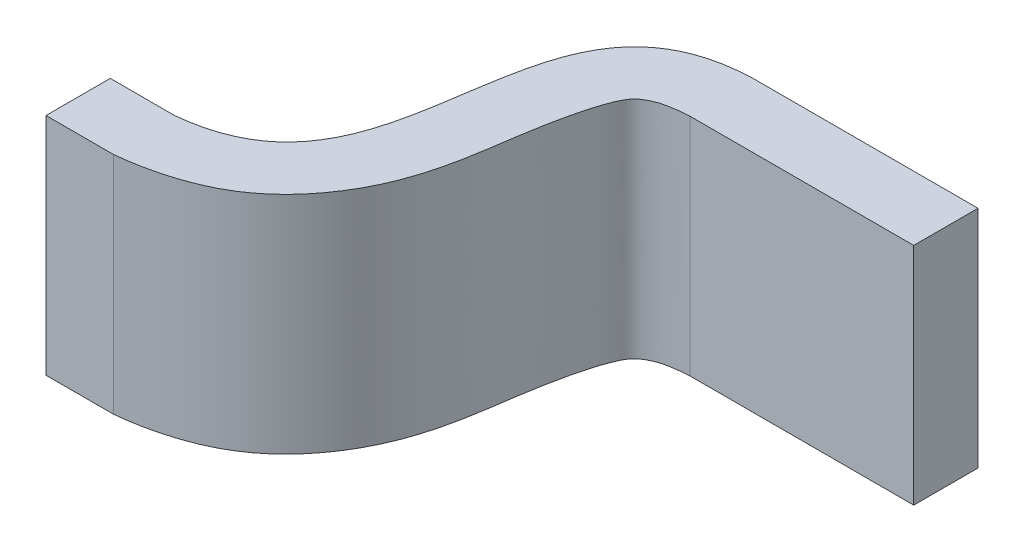
ISO-10303-21;
HEADER;
FILE_DESCRIPTION(('STEP AP214'),'2;1');
FILE_NAME('part.step','',(''),(''),'','','');
FILE_SCHEMA(('AUTOMOTIVE_DESIGN { 1 0 10303 214 1 1 1 1 }'));
ENDSEC;
DATA;
#1=APPLICATION_CONTEXT('core data for automotive mechanical design processes');
#2=APPLICATION_PROTOCOL_DEFINITION('international standard','automotive_design',2000,#1);
#3=PRODUCT_CONTEXT('',#1,'mechanical');
#4=PRODUCT('Part','Part','',(#3));
#5=PRODUCT_RELATED_PRODUCT_CATEGORY('part','',(#4));
#6=PRODUCT_DEFINITION_FORMATION('','',#4);
#7=PRODUCT_DEFINITION_CONTEXT('part definition',#1,'design');
#8=PRODUCT_DEFINITION('design','',#6,#7);
#9=PRODUCT_DEFINITION_SHAPE('','',#8);
#10=(LENGTH_UNIT() NAMED_UNIT(*) SI_UNIT(.MILLI.,.METRE.));
#11=(NAMED_UNIT(*) PLANE_ANGLE_UNIT() SI_UNIT($,.RADIAN.));
#12=(NAMED_UNIT(*) SI_UNIT($,.STERADIAN.) SOLID_ANGLE_UNIT());
#13=UNCERTAINTY_MEASURE_WITH_UNIT(LENGTH_MEASURE(1.E-05),#10,'distance_accuracy_value','');
#14=(GEOMETRIC_REPRESENTATION_CONTEXT(3) GLOBAL_UNCERTAINTY_ASSIGNED_CONTEXT((#13)) GLOBAL_UNIT_ASSIGNED_CONTEXT((#10,
#11,#12)) REPRESENTATION_CONTEXT('',''));
#15=CARTESIAN_POINT('',(0.,0.,0.));
#16=DIRECTION('',(0.,0.,1.));
#17=DIRECTION('',(1.,0.,0.));
#18=AXIS2_PLACEMENT_3D('',#15,#16,#17);
#19=CARTESIAN_POINT('',(0.381074398756027,-1.47690082967439,1.19999994098963));
#20=DIRECTION('',(0.,1.,4.37113882867379E-08));
#21=DIRECTION('',(-1.,0.,0.));
#22=AXIS2_PLACEMENT_3D('',#19,#20,#21);
#23=PLANE('',#22);
#24=DIRECTION('',(1.,0.,0.));
#25=VECTOR('',#24,1.);
#26=CARTESIAN_POINT('',(8.21957818049203,-1.476900785963,0.199999940989626));
#27=LINE('',#26,#25);
#28=CARTESIAN_POINT('',(8.21957818049203,-1.476900785963,0.199999940989626));
#29=VERTEX_POINT('',#28);
#30=CARTESIAN_POINT('',(8.91607439875603,-1.476900785963,0.199999940989626));
#31=VERTEX_POINT('',#30);
#32=EDGE_CURVE('E11',#29,#31,#27,.T.);
#33=ORIENTED_EDGE('',*,*,#32,.F.);
#34=CARTESIAN_POINT('',(8.21957818049203,-1.476900785963,0.199999940989626));
#35=CARTESIAN_POINT('',(8.21401047042364,-1.47690078597273,0.200222602099352));
#36=CARTESIAN_POINT('',(8.2084492375196,-1.47690078598803,0.200572467057035));
#37=CARTESIAN_POINT('',(8.19734075645456,-1.4769007860286,0.201500599557958));
#38=CARTESIAN_POINT('',(8.19179352491145,-1.47690078605388,0.20207906786945));
#39=CARTESIAN_POINT('',(8.1806812900785,-1.47690078611351,0.203443147589108));
#40=CARTESIAN_POINT('',(8.17511647873245,-1.47690078614792,0.204230319381954));
#41=CARTESIAN_POINT('',(8.16402483417436,-1.47690078622667,0.206031850609965));
#42=CARTESIAN_POINT('',(8.15849799412173,-1.476900786271,0.20704616795629));
#43=CARTESIAN_POINT('',(8.14658674806992,-1.47690078638383,0.209627265093131));
#44=CARTESIAN_POINT('',(8.14021486717337,-1.47690078645513,0.211258358150452));
#45=CARTESIAN_POINT('',(8.12922884181096,-1.4769007866137,0.214886107390859));
#46=CARTESIAN_POINT('',(8.12455816053053,-1.4769007866931,0.216702585725699));
#47=CARTESIAN_POINT('',(8.11576316126025,-1.47690078686971,0.220742965728565));
#48=CARTESIAN_POINT('',(8.11162296951039,-1.47690078696547,0.222933854437321));
#49=CARTESIAN_POINT('',(8.10254423156373,-1.47690078719153,0.228105114025309));
#50=CARTESIAN_POINT('',(8.09763875402522,-1.47690078732472,0.231151620713566));
#51=CARTESIAN_POINT('',(8.09023645619511,-1.47690078758168,0.237031319573506));
#52=CARTESIAN_POINT('',(8.08750404217203,-1.47690078769192,0.239554011267644));
#53=CARTESIAN_POINT('',(8.08247327048636,-1.47690078793018,0.245002656510498));
#54=CARTESIAN_POINT('',(8.08017570164472,-1.47690078805824,0.247929326572814));
#55=CARTESIAN_POINT('',(8.07600750655781,-1.47690078832182,0.25396046141144));
#56=CARTESIAN_POINT('',(8.07412791295759,-1.47690078845709,0.257058928893301));
#57=CARTESIAN_POINT('',(8.07061884711942,-1.47690078873403,0.263392808416967));
#58=CARTESIAN_POINT('',(8.06898949912773,-1.47690078887571,0.26662828747419));
#59=CARTESIAN_POINT('',(8.06368568552224,-1.47690078936694,0.277849786579687));
#60=CARTESIAN_POINT('',(8.0604132563502,-1.47690078972441,0.286021972777192));
#61=CARTESIAN_POINT('',(8.05219767575064,-1.47690079070356,0.308422084191397));
#62=CARTESIAN_POINT('',(8.04772694785476,-1.47690079133187,0.322813177466201));
#63=CARTESIAN_POINT('',(8.03962993037267,-1.47690079258385,0.351469842707259));
#64=CARTESIAN_POINT('',(8.03598677320327,-1.4769007932073,0.365730846318129));
#65=CARTESIAN_POINT('',(8.0292057912753,-1.47690079445887,0.394362061181508));
#66=CARTESIAN_POINT('',(8.026067670572,-1.47690079508699,0.408732203271951));
#67=CARTESIAN_POINT('',(8.01737649852023,-1.47690079694064,0.451139464717596));
#68=CARTESIAN_POINT('',(8.01233758089064,-1.47690079817083,0.479282677822179));
#69=CARTESIAN_POINT('',(8.0033688768371,-1.47690080064178,0.535811116286049));
#70=CARTESIAN_POINT('',(7.99944209123786,-1.47690080188255,0.564196787472043));
#71=CARTESIAN_POINT('',(7.99171406777027,-1.47690080413513,0.615729708611764));
#72=CARTESIAN_POINT('',(7.98801955213797,-1.47690080514758,0.638892051638555));
#73=CARTESIAN_POINT('',(7.97944793328662,-1.47690080716328,0.685005751083002));
#74=CARTESIAN_POINT('',(7.97457098452208,-1.47690080816652,0.707957134651016));
#75=CARTESIAN_POINT('',(7.96312511462686,-1.47690081014989,0.753331539683629));
#76=CARTESIAN_POINT('',(7.95656434385538,-1.47690081113012,0.7757565536442));
#77=CARTESIAN_POINT('',(7.94138023978948,-1.47690081305941,0.819893592793445));
#78=CARTESIAN_POINT('',(7.93275798105253,-1.47690081400849,0.841605982756187));
#79=CARTESIAN_POINT('',(7.91045031887107,-1.47690081613078,0.890158317257776));
#80=CARTESIAN_POINT('',(7.89602176505836,-1.47690081728932,0.916662583594958));
#81=CARTESIAN_POINT('',(7.86348674764205,-1.47690081950771,0.967413343835514));
#82=CARTESIAN_POINT('',(7.84537217243352,-1.47690082056733,0.991654683188965));
#83=CARTESIAN_POINT('',(7.80791242379023,-1.47690082242581,1.0341715470258));
#84=CARTESIAN_POINT('',(7.78898672481745,-1.47690082324069,1.05281409028392));
#85=CARTESIAN_POINT('',(7.74845805610151,-1.47690082472744,1.08682689740164));
#86=CARTESIAN_POINT('',(7.72686395650978,-1.47690082539975,1.10220756450255));
#87=CARTESIAN_POINT('',(7.68360712676313,-1.47690082651875,1.12780720142861));
#88=CARTESIAN_POINT('',(7.66215097272193,-1.47690082698092,1.13838045617139));
#89=CARTESIAN_POINT('',(7.61807803282734,-1.47690082779152,1.15692483476231));
#90=CARTESIAN_POINT('',(7.59545709543127,-1.4769008281395,1.16488578060009));
#91=CARTESIAN_POINT('',(7.54849735175116,-1.47690082874837,1.17881501865543));
#92=CARTESIAN_POINT('',(7.52412722595023,-1.47690082900456,1.18467606433587));
#93=CARTESIAN_POINT('',(7.47515350623731,-1.47690082941337,1.19402859653764));
#94=CARTESIAN_POINT('',(7.45055381030962,-1.47690082956687,1.19754033118794));
#95=CARTESIAN_POINT('',(7.42587357560403,-1.47690082967439,1.19999994098963));
#96=B_SPLINE_CURVE_WITH_KNOTS('',3,(#34,#35,#36,#37,#38,#39,#40,#41,#42,#43,#44,#45,#46,#47,#48,
#49,#50,#51,#52,#53,#54,#55,#56,#57,#58,#59,#60,#61,#62,#63,#64,#65,#66,#67,#68,#69,#70,#71,#72,
#73,#74,#75,#76,#77,#78,#79,#80,#81,#82,#83,#84,#85,#86,#87,#88,#89,#90,#91,#92,#93,#94,#95),
.UNSPECIFIED.,.F.,.F.,(4,2,2,2,2,2,2,2,2,2,2,2,2,2,2,2,2,2,2,2,2,2,2,2,2,2,2,2,2,2,4),(0.,
0.0167129049826591,0.0334405206169248,0.0502969119078445,0.0671501823813316,0.0868449977925688,
0.101838970321099,0.115885127156854,0.133132127804881,0.144236213112229,0.155360252414292,
0.166215762863012,0.177076645740442,0.203446553112077,0.248618617741094,0.292765096579114,
0.336885611219414,0.42262238002304,0.508588331833535,0.578941414817071,0.649285312924718,
0.719294937731863,0.789268149044624,0.879502218060835,0.969937050040232,1.04934324822106,
1.12849225200604,1.200024637838,1.27183250557102,1.34691026454657,1.42133231106535),.UNSPECIFIED.);
#97=CARTESIAN_POINT('',(7.42587357560403,-1.47690082967439,1.19999994098963));
#98=VERTEX_POINT('',#97);
#99=EDGE_CURVE('E186',#29,#98,#96,.T.);
#100=ORIENTED_EDGE('',*,*,#99,.T.);
#101=DIRECTION('',(1.,0.,0.));
#102=VECTOR('',#101,1.);
#103=CARTESIAN_POINT('',(7.21607439875603,-1.47690082967439,1.19999994098963));
#104=LINE('',#103,#102);
#105=CARTESIAN_POINT('',(7.21607439875603,-1.47690082967439,1.19999994098963));
#106=VERTEX_POINT('',#105);
#107=EDGE_CURVE('E163',#106,#98,#104,.T.);
#108=ORIENTED_EDGE('',*,*,#107,.F.);
#109=DIRECTION('',(0.,4.37113878426487E-08,-0.999999999999999));
#110=VECTOR('',#109,1.);
#111=CARTESIAN_POINT('',(7.21607439875603,-1.47690082967439,1.19999994098963));
#112=LINE('',#111,#110);
#113=CARTESIAN_POINT('',(7.21607439875603,-1.47690082093211,0.999999940989626));
#114=VERTEX_POINT('',#113);
#115=EDGE_CURVE('E155',#106,#114,#112,.T.);
#116=ORIENTED_EDGE('',*,*,#115,.T.);
#117=DIRECTION('',(-1.,0.,0.));
#118=VECTOR('',#117,1.);
#119=CARTESIAN_POINT('',(7.41607439875603,-1.47690082093211,0.999999940989626));
#120=LINE('',#119,#118);
#121=CARTESIAN_POINT('',(7.41607439875603,-1.47690082093211,0.999999940989626));
#122=VERTEX_POINT('',#121);
#123=EDGE_CURVE('E148',#122,#114,#120,.T.);
#124=ORIENTED_EDGE('',*,*,#123,.F.);
#125=CARTESIAN_POINT('',(8.21607439875603,-1.47690077722073,-5.90103741720499E-08));
#126=CARTESIAN_POINT('',(8.19359750090305,-1.47690077725359,0.000751885623031084));
#127=CARTESIAN_POINT('',(8.17102033253113,-1.47690077733126,0.00252883893298942));
#128=CARTESIAN_POINT('',(8.12598549255526,-1.47690077761353,0.0089862253883226));
#129=CARTESIAN_POINT('',(8.10353378116303,-1.47690077781986,0.0137064325656271));
#130=CARTESIAN_POINT('',(8.06516605596456,-1.47690077832605,0.0252868334657571));
#131=CARTESIAN_POINT('',(8.04901169028135,-1.47690077858996,0.0313244122267574));
#132=CARTESIAN_POINT('',(8.01790380459713,-1.47690077922343,0.045816445642595));
#133=CARTESIAN_POINT('',(8.00294442627384,-1.47690077959243,0.0542580473634454));
#134=CARTESIAN_POINT('',(7.97582167191426,-1.47690078040506,0.0728488263759812));
#135=CARTESIAN_POINT('',(7.96353091436025,-1.47690078084053,0.0828114022949691));
#136=CARTESIAN_POINT('',(7.94070621502396,-1.47690078179279,0.104596546543679));
#137=CARTESIAN_POINT('',(7.93017445817697,-1.47690078230967,0.116421393196581));
#138=CARTESIAN_POINT('',(7.90935508116188,-1.4769007834979,0.143604990461998));
#139=CARTESIAN_POINT('',(7.89940970116877,-1.47690078418059,0.159223219035323));
#140=CARTESIAN_POINT('',(7.88179108799282,-1.47690078560041,0.191704849783173));
#141=CARTESIAN_POINT('',(7.8741236490106,-1.47690078633767,0.20857129324181));
#142=CARTESIAN_POINT('',(7.85832464058284,-1.47690078809626,0.248803257681499));
#143=CARTESIAN_POINT('',(7.85090890706548,-1.47690078912954,0.272441945859291));
#144=CARTESIAN_POINT('',(7.83820894045457,-1.47690079121847,0.320230952552114));
#145=CARTESIAN_POINT('',(7.8329235985232,-1.4769007922741,0.344380998005618));
#146=CARTESIAN_POINT('',(7.82020763349267,-1.47690079514812,0.410130867006333));
#147=CARTESIAN_POINT('',(7.81392194525157,-1.4769007969754,0.451934227237509));
#148=CARTESIAN_POINT('',(7.80124280837881,-1.47690080063979,0.535765753860262));
#149=CARTESIAN_POINT('',(7.79484895474966,-1.47690080247691,0.577793876847089));
#150=CARTESIAN_POINT('',(7.782739848071,-1.47690080516847,0.639369673752824));
#151=CARTESIAN_POINT('',(7.77842057810017,-1.47690080603403,0.659171608041227));
#152=CARTESIAN_POINT('',(7.76847573352189,-1.47690080775189,0.698471663366859));
#153=CARTESIAN_POINT('',(7.76284917548215,-1.47690080860417,0.717969543831357));
#154=CARTESIAN_POINT('',(7.74981596903728,-1.47690081027332,0.75615518982032));
#155=CARTESIAN_POINT('',(7.74242864611761,-1.47690081109047,0.774849314908155));
#156=CARTESIAN_POINT('',(7.72530005700014,-1.47690081267529,0.811105873354097));
#157=CARTESIAN_POINT('',(7.71556458954354,-1.47690081344308,0.828670961591231));
#158=CARTESIAN_POINT('',(7.69292951988902,-1.47690081492352,0.862539441280772));
#159=CARTESIAN_POINT('',(7.67993520495926,-1.47690081563347,0.878781202559519));
#160=CARTESIAN_POINT('',(7.65100399267901,-1.47690081692777,0.908391301293334));
#161=CARTESIAN_POINT('',(7.63506980602138,-1.47690081751224,0.921762261379835));
#162=CARTESIAN_POINT('',(7.60252456066282,-1.47690081848615,0.944042754430358));
#163=CARTESIAN_POINT('',(7.58611569627056,-1.47690081888871,0.953252327062622));
#164=CARTESIAN_POINT('',(7.55201487673193,-1.47690081957839,0.969030353620421));
#165=CARTESIAN_POINT('',(7.53431790582258,-1.47690081986502,0.975587750967199));
#166=CARTESIAN_POINT('',(7.4998876879737,-1.47690082031487,0.985879039904428));
#167=CARTESIAN_POINT('',(7.48321202321778,-1.4769008204869,0.989814647153144));
#168=CARTESIAN_POINT('',(7.44972396115948,-1.47690082075885,0.99603614183989));
#169=CARTESIAN_POINT('',(7.43291463042139,-1.47690082085947,0.99833823845773));
#170=CARTESIAN_POINT('',(7.41607439875603,-1.47690082093211,0.999999940989626));
#171=B_SPLINE_CURVE_WITH_KNOTS('',3,(#125,#126,#127,#128,#129,#130,#131,#132,#133,#134,#135,
#136,#137,#138,#139,#140,#141,#142,#143,#144,#145,#146,#147,#148,#149,#150,#151,#152,#153,#154,
#155,#156,#157,#158,#159,#160,#161,#162,#163,#164,#165,#166,#167,#168,#169,#170),.UNSPECIFIED.,
.F.,.F.,(4,2,2,2,2,2,2,2,2,2,2,2,2,2,2,2,2,2,2,2,2,2,4),(0.,0.0676605368254357,
0.136255841823746,0.187815232472052,0.239103979458826,0.286357475935168,0.333669238509407,
0.388978971846575,0.444428210357162,0.518581097757567,0.592695339665641,0.719482422739697,
0.846974988060583,0.907746805484859,0.968564488536609,1.02874313069962,1.08877465652057,
1.15080863583324,1.21278570033355,1.26897458836371,1.32539536427915,1.3767136749948,
1.42751535438906),.UNSPECIFIED.);
#172=CARTESIAN_POINT('',(8.21607439875603,-1.47690077722073,-5.90103741870962E-08));
#173=VERTEX_POINT('',#172);
#174=EDGE_CURVE('E99',#173,#122,#171,.T.);
#175=ORIENTED_EDGE('',*,*,#174,.F.);
#176=DIRECTION('',(1.,0.,0.));
#177=VECTOR('',#176,1.);
#178=CARTESIAN_POINT('',(8.21607439875603,-1.47690077722073,-5.90103741870963E-08));
#179=LINE('',#178,#177);
#180=CARTESIAN_POINT('',(8.91607439875603,-1.47690077722073,-5.90103741870962E-08));
#181=VERTEX_POINT('',#180);
#182=EDGE_CURVE('E93',#173,#181,#179,.T.);
#183=ORIENTED_EDGE('',*,*,#182,.T.);
#184=DIRECTION('',(0.,4.37113878426487E-08,-0.999999999999999));
#185=VECTOR('',#184,1.);
#186=CARTESIAN_POINT('',(8.91607439875603,-1.476900785963,0.199999940989626));
#187=LINE('',#186,#185);
#188=EDGE_CURVE('E194',#31,#181,#187,.T.);
#189=ORIENTED_EDGE('',*,*,#188,.F.);
#190=EDGE_LOOP('',(#33,#100,#108,#116,#124,#175,#183,#189));
#191=FACE_BOUND('',#190,.T.);
#192=ADVANCED_FACE('F17',(#191),#23,.F.);
#193=CARTESIAN_POINT('',(8.91607439875603,-0.126900829674392,1.2));
#194=DIRECTION('',(-1.,0.,0.));
#195=DIRECTION('',(0.,-1.,-4.37113882867379E-08));
#196=AXIS2_PLACEMENT_3D('',#193,#194,#195);
#197=PLANE('',#196);
#198=DIRECTION('',(0.,-0.999999999999999,-4.37113883184584E-08));
#199=VECTOR('',#198,1.);
#200=CARTESIAN_POINT('',(8.91607439875602,-0.776900785963002,0.199999971587598));
#201=LINE('',#200,#199);
#202=CARTESIAN_POINT('',(8.91607439875603,-0.776900785963004,0.199999971587598));
#203=VERTEX_POINT('',#202);
#204=EDGE_CURVE('E25',#203,#31,#201,.T.);
#205=ORIENTED_EDGE('',*,*,#204,.T.);
#206=ORIENTED_EDGE('',*,*,#188,.T.);
#207=DIRECTION('',(0.,0.999999999999999,4.37113882867379E-08));
#208=VECTOR('',#207,1.);
#209=CARTESIAN_POINT('',(8.91607439875603,-1.47690077722073,-5.90103741870962E-08));
#210=LINE('',#209,#208);
#211=CARTESIAN_POINT('',(8.91607439875603,-0.776900777220726,-2.84124023863797E-08));
#212=VERTEX_POINT('',#211);
#213=EDGE_CURVE('E157',#181,#212,#210,.T.);
#214=ORIENTED_EDGE('',*,*,#213,.T.);
#215=DIRECTION('',(0.,4.37113883977602E-08,-0.999999999999999));
#216=VECTOR('',#215,1.);
#217=CARTESIAN_POINT('',(8.91607439875603,-0.776900785963004,0.199999971587598));
#218=LINE('',#217,#216);
#219=EDGE_CURVE('E150',#203,#212,#218,.T.);
#220=ORIENTED_EDGE('',*,*,#219,.F.);
#221=EDGE_LOOP('',(#205,#206,#214,#220));
#222=FACE_BOUND('',#221,.T.);
#223=ADVANCED_FACE('F205',(#222),#197,.F.);
#224=CARTESIAN_POINT('',(0.381074398756027,-0.776900829674392,1.1999999715876));
#225=DIRECTION('',(0.,1.,4.37113882867379E-08));
#226=DIRECTION('',(-1.,0.,0.));
#227=AXIS2_PLACEMENT_3D('',#224,#225,#226);
#228=PLANE('',#227);
#229=CARTESIAN_POINT('',(8.21957818049203,-0.776900785963005,0.199999971587598));
#230=CARTESIAN_POINT('',(8.21401047042364,-0.776900785972738,0.200222632697324));
#231=CARTESIAN_POINT('',(8.2084492375196,-0.776900785988032,0.200572497655007));
#232=CARTESIAN_POINT('',(8.19734075645456,-0.776900786028602,0.20150063015593));
#233=CARTESIAN_POINT('',(8.19179352491145,-0.776900786053887,0.202079098467422));
#234=CARTESIAN_POINT('',(8.1806812900785,-0.776900786113513,0.20344317818708));
#235=CARTESIAN_POINT('',(8.17511647873245,-0.776900786147922,0.204230349979926));
#236=CARTESIAN_POINT('',(8.16402483417436,-0.776900786226668,0.206031881207937));
#237=CARTESIAN_POINT('',(8.15849799412173,-0.776900786271004,0.207046198554262));
#238=CARTESIAN_POINT('',(8.14658674806992,-0.776900786383832,0.209627295691104));
#239=CARTESIAN_POINT('',(8.14021486717337,-0.776900786455138,0.211258388748426));
#240=CARTESIAN_POINT('',(8.12922884181096,-0.77690078661369,0.214886137988831));
#241=CARTESIAN_POINT('',(8.12455816053052,-0.776900786693069,0.216702616323669));
#242=CARTESIAN_POINT('',(8.11576316126025,-0.77690078686974,0.220742996326536));
#243=CARTESIAN_POINT('',(8.11162296951039,-0.776900786965583,0.222933885035293));
#244=CARTESIAN_POINT('',(8.10254423156373,-0.776900787191377,0.228105144623282));
#245=CARTESIAN_POINT('',(8.09763875402522,-0.776900787324125,0.231151651311538));
#246=CARTESIAN_POINT('',(8.09023645619511,-0.776900787581892,0.237031350171478));
#247=CARTESIAN_POINT('',(8.08750404217203,-0.776900787692822,0.239554041865617));
#248=CARTESIAN_POINT('',(8.08247327048636,-0.776900787929282,0.245002687108471));
#249=CARTESIAN_POINT('',(8.08017570164472,-0.776900788054837,0.247929357170786));
#250=CARTESIAN_POINT('',(8.07600750655781,-0.776900788319337,0.253960492009412));
#251=CARTESIAN_POINT('',(8.0741279129576,-0.776900788457886,0.257058959491274));
#252=CARTESIAN_POINT('',(8.07061884711942,-0.776900788733242,0.263392839014939));
#253=CARTESIAN_POINT('',(8.06898949912774,-0.776900788870048,0.266628318072162));
#254=CARTESIAN_POINT('',(8.06368568552224,-0.776900789347342,0.277849817177657));
#255=CARTESIAN_POINT('',(8.06041325635019,-0.776900789699721,0.286022003375161));
#256=CARTESIAN_POINT('',(8.05219767575063,-0.776900790678586,0.308422114789367));
#257=CARTESIAN_POINT('',(8.04772694785476,-0.776900791321367,0.322813208064173));
#258=CARTESIAN_POINT('',(8.03962993037268,-0.77690079258594,0.351469873305231));
#259=CARTESIAN_POINT('',(8.03598677320328,-0.776900793207877,0.3657308769161));
#260=CARTESIAN_POINT('',(8.0292057912753,-0.776900794458301,0.394362091779478));
#261=CARTESIAN_POINT('',(8.026067670572,-0.776900795086784,0.408732233869921));
#262=CARTESIAN_POINT('',(8.01737649852023,-0.776900796941005,0.451139495315567));
#263=CARTESIAN_POINT('',(8.01233758089064,-0.776900798170934,0.479282708420149));
#264=CARTESIAN_POINT('',(8.0033688768371,-0.776900800641686,0.535811146884019));
#265=CARTESIAN_POINT('',(7.99944209123786,-0.776900801882528,0.564196818070013));
#266=CARTESIAN_POINT('',(7.99171406777027,-0.776900804135145,0.615729739209734));
#267=CARTESIAN_POINT('',(7.98801955213797,-0.776900805147593,0.638892082236526));
#268=CARTESIAN_POINT('',(7.97944793328662,-0.776900807163279,0.685005781680973));
#269=CARTESIAN_POINT('',(7.97457098452208,-0.776900808166519,0.707957165248986));
#270=CARTESIAN_POINT('',(7.96312511462686,-0.776900810149899,0.753331570281599));
#271=CARTESIAN_POINT('',(7.95656434385538,-0.776900811130127,0.77575658424217));
#272=CARTESIAN_POINT('',(7.94138023978948,-0.776900813059417,0.819893623391415));
#273=CARTESIAN_POINT('',(7.93275798105253,-0.776900814008494,0.841606013354157));
#274=CARTESIAN_POINT('',(7.91045031887107,-0.776900816130784,0.890158347855747));
#275=CARTESIAN_POINT('',(7.89602176505836,-0.776900817289324,0.91666261419293));
#276=CARTESIAN_POINT('',(7.86348674764205,-0.776900819507711,0.967413374433486));
#277=CARTESIAN_POINT('',(7.84537217243352,-0.776900820567331,0.991654713786935));
#278=CARTESIAN_POINT('',(7.80791242379023,-0.776900822425803,1.03417157762377));
#279=CARTESIAN_POINT('',(7.78898672481745,-0.776900823240696,1.05281412088189));
#280=CARTESIAN_POINT('',(7.74845805610151,-0.776900824727443,1.08682692799962));
#281=CARTESIAN_POINT('',(7.72686395650978,-0.776900825399753,1.10220759510053));
#282=CARTESIAN_POINT('',(7.68360712676313,-0.776900826518748,1.12780723202658));
#283=CARTESIAN_POINT('',(7.66215097272193,-0.77690082698092,1.13838048676936));
#284=CARTESIAN_POINT('',(7.61807803282734,-0.776900827791521,1.15692486536028));
#285=CARTESIAN_POINT('',(7.59545709543127,-0.776900828139505,1.16488581119806));
#286=CARTESIAN_POINT('',(7.54849735175116,-0.776900828748371,1.1788150492534));
#287=CARTESIAN_POINT('',(7.52412722595023,-0.776900829004566,1.18467609493384));
#288=CARTESIAN_POINT('',(7.47515350623731,-0.776900829413378,1.19402862713561));
#289=CARTESIAN_POINT('',(7.45055381030962,-0.77690082956688,1.19754036178591));
#290=CARTESIAN_POINT('',(7.42587357560403,-0.776900829674392,1.1999999715876));
#291=B_SPLINE_CURVE_WITH_KNOTS('',3,(#229,#230,#231,#232,#233,#234,#235,#236,#237,#238,#239,
#240,#241,#242,#243,#244,#245,#246,#247,#248,#249,#250,#251,#252,#253,#254,#255,#256,#257,#258,
#259,#260,#261,#262,#263,#264,#265,#266,#267,#268,#269,#270,#271,#272,#273,#274,#275,#276,#277,
#278,#279,#280,#281,#282,#283,#284,#285,#286,#287,#288,#289,#290),.UNSPECIFIED.,.F.,.F.,(4,2,2,
2,2,2,2,2,2,2,2,2,2,2,2,2,2,2,2,2,2,2,2,2,2,2,2,2,2,2,4),(0.,0.0167129049826574,
0.0334405206169266,0.0502969119078462,0.0671501823813317,0.0868449977925689,0.101838970321109,
0.115885127156855,0.133132127804881,0.144236213112229,0.155360252414293,0.166215762863011,
0.177076645740442,0.20344655311208,0.248618617741091,0.292765096579113,0.336885611219413,
0.422622380023038,0.508588331833534,0.57894141481707,0.649285312924716,0.719294937731862,
0.789268149044623,0.879502218060835,0.969937050040231,1.04934324822106,1.12849225200604,
1.200024637838,1.27183250557102,1.34691026454657,1.42133231106535),.UNSPECIFIED.);
#292=CARTESIAN_POINT('',(8.21957818049203,-0.776900785963004,0.199999971587598));
#293=VERTEX_POINT('',#292);
#294=CARTESIAN_POINT('',(7.42587357560403,-0.776900829674392,1.1999999715876));
#295=VERTEX_POINT('',#294);
#296=EDGE_CURVE('E180',#293,#295,#291,.T.);
#297=ORIENTED_EDGE('',*,*,#296,.F.);
#298=DIRECTION('',(1.,0.,0.));
#299=VECTOR('',#298,1.);
#300=CARTESIAN_POINT('',(8.21957818049203,-0.776900785963006,0.199999971587597));
#301=LINE('',#300,#299);
#302=EDGE_CURVE('E159',#293,#203,#301,.T.);
#303=ORIENTED_EDGE('',*,*,#302,.T.);
#304=ORIENTED_EDGE('',*,*,#219,.T.);
#305=DIRECTION('',(1.,0.,0.));
#306=VECTOR('',#305,1.);
#307=CARTESIAN_POINT('',(8.21607439875603,-0.776900777220728,-2.84124023863797E-08));
#308=LINE('',#307,#306);
#309=CARTESIAN_POINT('',(8.21607439875603,-0.776900777220726,-2.84124023863797E-08));
#310=VERTEX_POINT('',#309);
#311=EDGE_CURVE('E89',#310,#212,#308,.T.);
#312=ORIENTED_EDGE('',*,*,#311,.F.);
#313=CARTESIAN_POINT('',(8.21607439875603,-0.776900777220727,-2.84124024085841E-08));
#314=CARTESIAN_POINT('',(8.19359750090305,-0.776900777253597,0.000751916221003097));
#315=CARTESIAN_POINT('',(8.17102033253113,-0.77690077733127,0.00252886953096133));
#316=CARTESIAN_POINT('',(8.12598549255526,-0.776900777613531,0.00898625598629423));
#317=CARTESIAN_POINT('',(8.10353378116303,-0.776900777819857,0.0137064631635985));
#318=CARTESIAN_POINT('',(8.06516605596456,-0.776900778326053,0.0252868640637288));
#319=CARTESIAN_POINT('',(8.04901169028135,-0.776900778589964,0.0313244428247295));
#320=CARTESIAN_POINT('',(8.01790380459713,-0.776900779223431,0.0458164762405673));
#321=CARTESIAN_POINT('',(8.00294442627384,-0.776900779592424,0.0542580779614174));
#322=CARTESIAN_POINT('',(7.97582167191426,-0.776900780405053,0.0728488569739531));
#323=CARTESIAN_POINT('',(7.96353091436025,-0.776900780840532,0.082811432892941));
#324=CARTESIAN_POINT('',(7.94070621502396,-0.776900781792791,0.104596577141651));
#325=CARTESIAN_POINT('',(7.93017445817697,-0.776900782309671,0.116421423794553));
#326=CARTESIAN_POINT('',(7.90935508116188,-0.776900783497904,0.143605021059969));
#327=CARTESIAN_POINT('',(7.89940970116876,-0.776900784180599,0.159223249633293));
#328=CARTESIAN_POINT('',(7.88179108799282,-0.776900785600415,0.191704880381143));
#329=CARTESIAN_POINT('',(7.8741236490106,-0.77690078633767,0.208571323839782));
#330=CARTESIAN_POINT('',(7.85832464058284,-0.776900788096265,0.24880328827947));
#331=CARTESIAN_POINT('',(7.85090890706547,-0.776900789129546,0.272441976457262));
#332=CARTESIAN_POINT('',(7.83820894045458,-0.77690079121847,0.320230983150084));
#333=CARTESIAN_POINT('',(7.83292359852321,-0.776900792274102,0.34438102860359));
#334=CARTESIAN_POINT('',(7.82020763349268,-0.77690079514812,0.410130897604307));
#335=CARTESIAN_POINT('',(7.81392194525158,-0.776900796975403,0.451934257835482));
#336=CARTESIAN_POINT('',(7.8012428083788,-0.776900800639795,0.535765784458233));
#337=CARTESIAN_POINT('',(7.79484895474965,-0.776900802476902,0.577793907445059));
#338=CARTESIAN_POINT('',(7.78273984807099,-0.776900805168466,0.639369704350797));
#339=CARTESIAN_POINT('',(7.77842057810017,-0.776900806034036,0.659171638639201));
#340=CARTESIAN_POINT('',(7.76847573352189,-0.776900807751897,0.698471693964835));
#341=CARTESIAN_POINT('',(7.76284917548215,-0.776900808604176,0.717969574429332));
#342=CARTESIAN_POINT('',(7.74981596903728,-0.776900810273324,0.756155220418294));
#343=CARTESIAN_POINT('',(7.74242864611761,-0.77690081109047,0.774849345506128));
#344=CARTESIAN_POINT('',(7.72530005700014,-0.776900812675294,0.811105903952069));
#345=CARTESIAN_POINT('',(7.71556458954354,-0.776900813443087,0.828670992189203));
#346=CARTESIAN_POINT('',(7.69292951988902,-0.776900814923525,0.862539471878744));
#347=CARTESIAN_POINT('',(7.67993520495926,-0.776900815633476,0.87878123315749));
#348=CARTESIAN_POINT('',(7.65100399267902,-0.776900816927776,0.908391331891305));
#349=CARTESIAN_POINT('',(7.63506980602138,-0.776900817512239,0.921762291977805));
#350=CARTESIAN_POINT('',(7.60252456066282,-0.77690081848615,0.944042785028329));
#351=CARTESIAN_POINT('',(7.58611569627056,-0.776900818888713,0.953252357660595));
#352=CARTESIAN_POINT('',(7.55201487673193,-0.776900819578393,0.969030384218394));
#353=CARTESIAN_POINT('',(7.53431790582258,-0.776900819865025,0.97558778156517));
#354=CARTESIAN_POINT('',(7.4998876879737,-0.776900820314872,0.985879070502399));
#355=CARTESIAN_POINT('',(7.48321202321778,-0.776900820486903,0.989814677751115));
#356=CARTESIAN_POINT('',(7.44972396115948,-0.776900820758853,0.996036172437862));
#357=CARTESIAN_POINT('',(7.43291463042139,-0.77690082085948,0.998338269055703));
#358=CARTESIAN_POINT('',(7.41607439875603,-0.776900820932115,0.999999971587598));
#359=B_SPLINE_CURVE_WITH_KNOTS('',3,(#313,#314,#315,#316,#317,#318,#319,#320,#321,#322,#323,
#324,#325,#326,#327,#328,#329,#330,#331,#332,#333,#334,#335,#336,#337,#338,#339,#340,#341,#342,
#343,#344,#345,#346,#347,#348,#349,#350,#351,#352,#353,#354,#355,#356,#357,#358),.UNSPECIFIED.,
.F.,.F.,(4,2,2,2,2,2,2,2,2,2,2,2,2,2,2,2,2,2,2,2,2,2,4),(0.,0.0676605368254357,
0.136255841823746,0.187815232472052,0.239103979458827,0.286357475935168,0.333669238509407,
0.388978971846573,0.444428210357163,0.518581097757565,0.592695339665639,0.719482422739697,
0.846974988060584,0.907746805484861,0.96856448853661,1.02874313069962,1.08877465652057,
1.15080863583324,1.21278570033355,1.26897458836371,1.32539536427915,1.3767136749948,
1.42751535438906),.UNSPECIFIED.);
#360=CARTESIAN_POINT('',(7.41607439875603,-0.776900820932114,0.999999971587598));
#361=VERTEX_POINT('',#360);
#362=EDGE_CURVE('E81',#310,#361,#359,.T.);
#363=ORIENTED_EDGE('',*,*,#362,.T.);
#364=DIRECTION('',(-1.,0.,0.));
#365=VECTOR('',#364,1.);
#366=CARTESIAN_POINT('',(7.41607439875603,-0.776900820932116,0.999999971587598));
#367=LINE('',#366,#365);
#368=CARTESIAN_POINT('',(7.21607439875603,-0.776900820932114,0.999999971587598));
#369=VERTEX_POINT('',#368);
#370=EDGE_CURVE('E86',#361,#369,#367,.T.);
#371=ORIENTED_EDGE('',*,*,#370,.T.);
#372=DIRECTION('',(0.,4.37113883977602E-08,-0.999999999999999));
#373=VECTOR('',#372,1.);
#374=CARTESIAN_POINT('',(7.21607439875603,-0.776900829674392,1.1999999715876));
#375=LINE('',#374,#373);
#376=CARTESIAN_POINT('',(7.21607439875603,-0.776900829674392,1.1999999715876));
#377=VERTEX_POINT('',#376);
#378=EDGE_CURVE('E161',#377,#369,#375,.T.);
#379=ORIENTED_EDGE('',*,*,#378,.F.);
#380=DIRECTION('',(1.,0.,0.));
#381=VECTOR('',#380,1.);
#382=CARTESIAN_POINT('',(7.21607439875603,-0.776900829674394,1.1999999715876));
#383=LINE('',#382,#381);
#384=EDGE_CURVE('E208',#377,#295,#383,.T.);
#385=ORIENTED_EDGE('',*,*,#384,.T.);
#386=EDGE_LOOP('',(#297,#303,#304,#312,#363,#371,#379,#385));
#387=FACE_BOUND('',#386,.T.);
#388=ADVANCED_FACE('F83',(#387),#228,.T.);
#389=CARTESIAN_POINT('',(7.21607439875603,-0.126900829674392,1.2));
#390=DIRECTION('',(-1.,0.,0.));
#391=DIRECTION('',(0.,-1.,-4.37113882867379E-08));
#392=AXIS2_PLACEMENT_3D('',#389,#390,#391);
#393=PLANE('',#392);
#394=ORIENTED_EDGE('',*,*,#378,.T.);
#395=DIRECTION('',(0.,-0.999999999999999,-4.37113881598551E-08));
#396=VECTOR('',#395,1.);
#397=CARTESIAN_POINT('',(7.21607439875603,-0.776900820932113,0.999999971587598));
#398=LINE('',#397,#396);
#399=EDGE_CURVE('E107',#369,#114,#398,.T.);
#400=ORIENTED_EDGE('',*,*,#399,.T.);
#401=ORIENTED_EDGE('',*,*,#115,.F.);
#402=DIRECTION('',(0.,0.999999999999999,4.37113881598553E-08));
#403=VECTOR('',#402,1.);
#404=CARTESIAN_POINT('',(7.21607439875603,-1.47690082967439,1.19999994098963));
#405=LINE('',#404,#403);
#406=EDGE_CURVE('E92',#106,#377,#405,.T.);
#407=ORIENTED_EDGE('',*,*,#406,.T.);
#408=EDGE_LOOP('',(#394,#400,#401,#407));
#409=FACE_BOUND('',#408,.T.);
#410=ADVANCED_FACE('F177',(#409),#393,.T.);
#411=CARTESIAN_POINT('',(0.381074398756027,-0.126900777220726,0.));
#412=DIRECTION('',(0.,-4.37113882867379E-08,1.));
#413=DIRECTION('',(0.,-1.,-4.37113882867379E-08));
#414=AXIS2_PLACEMENT_3D('',#411,#412,#413);
#415=PLANE('',#414);
#416=DIRECTION('',(0.,-0.999999999999999,-4.37113882867379E-08));
#417=VECTOR('',#416,1.);
#418=CARTESIAN_POINT('',(8.21607439875603,-0.776900777220726,-2.84124023863797E-08));
#419=LINE('',#418,#417);
#420=EDGE_CURVE('E153',#310,#173,#419,.T.);
#421=ORIENTED_EDGE('',*,*,#420,.F.);
#422=ORIENTED_EDGE('',*,*,#311,.T.);
#423=ORIENTED_EDGE('',*,*,#213,.F.);
#424=ORIENTED_EDGE('',*,*,#182,.F.);
#425=EDGE_LOOP('',(#421,#422,#423,#424));
#426=FACE_BOUND('',#425,.T.);
#427=ADVANCED_FACE('F129',(#426),#415,.F.);
#428=CARTESIAN_POINT('',(0.381074398756027,-0.126900829674392,1.2));
#429=DIRECTION('',(0.,-4.37113882867379E-08,1.));
#430=DIRECTION('',(0.,-1.,-4.37113882867379E-08));
#431=AXIS2_PLACEMENT_3D('',#428,#429,#430);
#432=PLANE('',#431);
#433=DIRECTION('',(0.,-0.999999999999999,-4.37113881598553E-08));
#434=VECTOR('',#433,1.);
#435=CARTESIAN_POINT('',(7.42587357560403,-0.776900829674392,1.1999999715876));
#436=LINE('',#435,#434);
#437=EDGE_CURVE('E145',#295,#98,#436,.T.);
#438=ORIENTED_EDGE('',*,*,#437,.F.);
#439=ORIENTED_EDGE('',*,*,#384,.F.);
#440=ORIENTED_EDGE('',*,*,#406,.F.);
#441=ORIENTED_EDGE('',*,*,#107,.T.);
#442=EDGE_LOOP('',(#438,#439,#440,#441));
#443=FACE_BOUND('',#442,.T.);
#444=ADVANCED_FACE('F199',(#443),#432,.T.);
#445=CARTESIAN_POINT('',(0.381074398756027,5.01772964056189,1.00000022487894));
#446=DIRECTION('',(0.,4.37113882867379E-08,-1.));
#447=DIRECTION('',(0.,1.,4.37113882867379E-08));
#448=AXIS2_PLACEMENT_3D('',#445,#446,#447);
#449=PLANE('',#448);
#450=ORIENTED_EDGE('',*,*,#123,.T.);
#451=ORIENTED_EDGE('',*,*,#399,.F.);
#452=ORIENTED_EDGE('',*,*,#370,.F.);
#453=DIRECTION('',(0.,-0.999999999999999,-4.37113881598551E-08));
#454=VECTOR('',#453,1.);
#455=CARTESIAN_POINT('',(7.41607439875602,-0.776900820932113,0.999999971587598));
#456=LINE('',#455,#454);
#457=EDGE_CURVE('E97',#361,#122,#456,.T.);
#458=ORIENTED_EDGE('',*,*,#457,.T.);
#459=EDGE_LOOP('',(#450,#451,#452,#458));
#460=FACE_BOUND('',#459,.T.);
#461=ADVANCED_FACE('F105',(#460),#449,.T.);
#462=CARTESIAN_POINT('',(7.41607439875603,5.01772964056189,1.00000022487894));
#463=CARTESIAN_POINT('',(8.06139179690003,5.01772964333266,0.93661226287194));
#464=CARTESIAN_POINT('',(7.55197768938303,5.01772968333384,0.0214920441178097));
#465=CARTESIAN_POINT('',(8.21607439875603,5.01772968427327,2.24878939694144E-07));
#466=B_SPLINE_CURVE_WITH_KNOTS('',3,(#462,#463,#464,#465),.UNSPECIFIED.,.F.,.F.,(4,4),(0.,1.),.UNSPECIFIED.);
#467=DIRECTION('',(0.,-0.999999999999999,-4.37113882867379E-08));
#468=VECTOR('',#467,1.);
#469=SURFACE_OF_LINEAR_EXTRUSION('',#466,#468);
#470=ORIENTED_EDGE('',*,*,#174,.T.);
#471=ORIENTED_EDGE('',*,*,#457,.F.);
#472=ORIENTED_EDGE('',*,*,#362,.F.);
#473=ORIENTED_EDGE('',*,*,#420,.T.);
#474=EDGE_LOOP('',(#470,#471,#472,#473));
#475=FACE_BOUND('',#474,.T.);
#476=ADVANCED_FACE('F98',(#475),#469,.T.);
#477=CARTESIAN_POINT('',(0.381074398756027,5.017729675531,0.20000022487894));
#478=DIRECTION('',(0.,-4.37113882867379E-08,1.));
#479=DIRECTION('',(-1.,0.,0.));
#480=AXIS2_PLACEMENT_3D('',#477,#478,#479);
#481=PLANE('',#480);
#482=ORIENTED_EDGE('',*,*,#32,.T.);
#483=ORIENTED_EDGE('',*,*,#204,.F.);
#484=ORIENTED_EDGE('',*,*,#302,.F.);
#485=DIRECTION('',(0.,-0.999999999999999,-4.37113883184584E-08));
#486=VECTOR('',#485,1.);
#487=CARTESIAN_POINT('',(8.21957818049202,-0.776900785963002,0.199999971587598));
#488=LINE('',#487,#486);
#489=EDGE_CURVE('E102',#293,#29,#488,.T.);
#490=ORIENTED_EDGE('',*,*,#489,.T.);
#491=EDGE_LOOP('',(#482,#483,#484,#490));
#492=FACE_BOUND('',#491,.T.);
#493=ADVANCED_FACE('F128',(#492),#481,.T.);
#494=CARTESIAN_POINT('',(7.42587357560403,5.01772963181961,1.20000022487894));
#495=CARTESIAN_POINT('',(7.52324797711103,5.0177296322377,1.19043537372094));
#496=CARTESIAN_POINT('',(7.72759639244103,5.01772963465043,1.13523848292794));
#497=CARTESIAN_POINT('',(7.96818915500203,5.01772964683219,0.85655227210794));
#498=CARTESIAN_POINT('',(8.00048622477203,5.01772966268883,0.49379478761794));
#499=CARTESIAN_POINT('',(8.06033428941003,5.01772967295241,0.25899132482694));
#500=CARTESIAN_POINT('',(8.09819089651203,5.01772967426447,0.22897490490494));
#501=CARTESIAN_POINT('',(8.14113192410003,5.01772967516896,0.20828275194794));
#502=CARTESIAN_POINT('',(8.19604029615203,5.01772967549165,0.20090043049794));
#503=CARTESIAN_POINT('',(8.21957818049203,5.017729675531,0.20000022487894));
#504=B_SPLINE_CURVE_WITH_KNOTS('',3,(#494,#495,#496,#497,#498,#499,#500,#501,#502,#503),
.UNSPECIFIED.,.F.,.F.,(4,1,1,1,1,1,1,4),(-0.005037439357121,0.120331553469,0.245700546295,
0.496438531947,0.747176517599,0.872545510425,0.935230006838,0.997914503251),.UNSPECIFIED.);
#505=DIRECTION('',(0.,-0.999999999999999,-4.37113882867379E-08));
#506=VECTOR('',#505,1.);
#507=SURFACE_OF_LINEAR_EXTRUSION('',#504,#506);
#508=ORIENTED_EDGE('',*,*,#489,.F.);
#509=ORIENTED_EDGE('',*,*,#296,.T.);
#510=ORIENTED_EDGE('',*,*,#437,.T.);
#511=ORIENTED_EDGE('',*,*,#99,.F.);
#512=EDGE_LOOP('',(#508,#509,#510,#511));
#513=FACE_BOUND('',#512,.T.);
#514=ADVANCED_FACE('F172',(#513),#507,.F.);
#515=CLOSED_SHELL('',(#192,#223,#388,#410,#427,#444,#461,#476,#493,#514));
#516=MANIFOLD_SOLID_BREP('B1',#515);
#517=ADVANCED_BREP_SHAPE_REPRESENTATION('',(#18,#516),#14);
#518=SHAPE_DEFINITION_REPRESENTATION(#9,#517);
ENDSEC;
END-ISO-10303-21;
